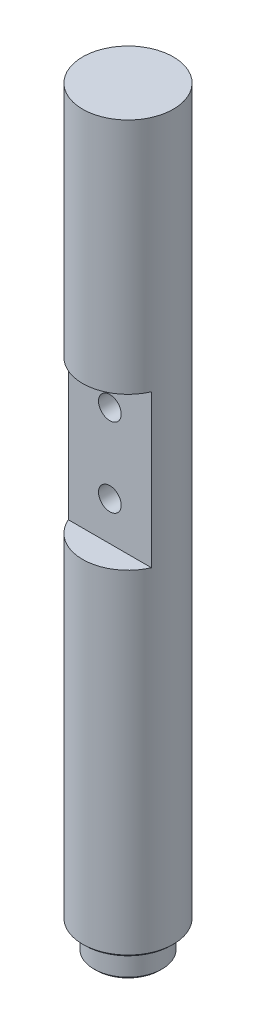
ISO-10303-21;
HEADER;
FILE_DESCRIPTION(('STEP AP214'),'2;1');
FILE_NAME('part.step','',(''),(''),'','','');
FILE_SCHEMA(('AUTOMOTIVE_DESIGN { 1 0 10303 214 1 1 1 1 }'));
ENDSEC;
DATA;
#1=APPLICATION_CONTEXT('core data for automotive mechanical design processes');
#2=APPLICATION_PROTOCOL_DEFINITION('international standard','automotive_design',2000,#1);
#3=PRODUCT_CONTEXT('',#1,'mechanical');
#4=PRODUCT('Part','Part','',(#3));
#5=PRODUCT_RELATED_PRODUCT_CATEGORY('part','',(#4));
#6=PRODUCT_DEFINITION_FORMATION('','',#4);
#7=PRODUCT_DEFINITION_CONTEXT('part definition',#1,'design');
#8=PRODUCT_DEFINITION('design','',#6,#7);
#9=PRODUCT_DEFINITION_SHAPE('','',#8);
#10=(LENGTH_UNIT() NAMED_UNIT(*) SI_UNIT(.MILLI.,.METRE.));
#11=(NAMED_UNIT(*) PLANE_ANGLE_UNIT() SI_UNIT($,.RADIAN.));
#12=(NAMED_UNIT(*) SI_UNIT($,.STERADIAN.) SOLID_ANGLE_UNIT());
#13=UNCERTAINTY_MEASURE_WITH_UNIT(LENGTH_MEASURE(1.E-05),#10,'distance_accuracy_value','');
#14=(GEOMETRIC_REPRESENTATION_CONTEXT(3) GLOBAL_UNCERTAINTY_ASSIGNED_CONTEXT((#13)) GLOBAL_UNIT_ASSIGNED_CONTEXT((#10,
#11,#12)) REPRESENTATION_CONTEXT('',''));
#15=CARTESIAN_POINT('',(0.,0.,0.));
#16=DIRECTION('',(0.,0.,1.));
#17=DIRECTION('',(1.,0.,0.));
#18=AXIS2_PLACEMENT_3D('',#15,#16,#17);
#19=CARTESIAN_POINT('',(0.,203.2,0.));
#20=DIRECTION('',(0.,-1.,0.));
#21=DIRECTION('',(0.,0.,-1.));
#22=AXIS2_PLACEMENT_3D('',#19,#20,#21);
#23=CYLINDRICAL_SURFACE('',#22,12.7);
#24=CARTESIAN_POINT('',(0.,130.175,-12.7));
#25=CARTESIAN_POINT('',(-0.175421054350933,130.174995077188,-12.6999970338729));
#26=CARTESIAN_POINT('',(-0.350897100741785,130.160412884195,-12.6963292371237));
#27=CARTESIAN_POINT('',(-0.696820051980964,130.102556763067,-12.6820530760661));
#28=CARTESIAN_POINT('',(-0.867264049209735,130.059266573145,-12.6714407780562));
#29=CARTESIAN_POINT('',(-1.19807751278645,129.945470246839,-12.6444507573613));
#30=CARTESIAN_POINT('',(-1.35845880926017,129.874996792719,-12.6280799601569));
#31=CARTESIAN_POINT('',(-1.6651226791977,129.708949391072,-12.591316443928));
#32=CARTESIAN_POINT('',(-1.81140477687155,129.613374596882,-12.5709235892463));
#33=CARTESIAN_POINT('',(-2.08873074612027,129.397758328565,-12.5278602543575));
#34=CARTESIAN_POINT('',(-2.21944287729589,129.277297166337,-12.5051546346353));
#35=CARTESIAN_POINT('',(-2.45903522924702,129.016226166276,-12.4602582924963));
#36=CARTESIAN_POINT('',(-2.56791298487578,128.875614056429,-12.4380676284689));
#37=CARTESIAN_POINT('',(-2.76230618225783,128.575656770073,-12.3963594189446));
#38=CARTESIAN_POINT('',(-2.84745052370821,128.416064328122,-12.3768864828385));
#39=CARTESIAN_POINT('',(-2.98957345643241,128.084265861986,-12.343330973648));
#40=CARTESIAN_POINT('',(-3.04655655068163,127.912061859447,-12.3292475388652));
#41=CARTESIAN_POINT('',(-3.12960773790342,127.56357626214,-12.3084267567388));
#42=CARTESIAN_POINT('',(-3.15627230130284,127.387445470053,-12.3015478927701));
#43=CARTESIAN_POINT('',(-3.17978742389056,127.033086528951,-12.2954915053947));
#44=CARTESIAN_POINT('',(-3.176642833515,126.854858725868,-12.2963127290578));
#45=CARTESIAN_POINT('',(-3.14110481048737,126.505936540272,-12.3054365167726));
#46=CARTESIAN_POINT('',(-3.1094221534035,126.335164267898,-12.3135572669877));
#47=CARTESIAN_POINT('',(-3.01884119561133,126.001439108905,-12.3360753547043));
#48=CARTESIAN_POINT('',(-2.95994095604688,125.838486780255,-12.3504731393489));
#49=CARTESIAN_POINT('',(-2.8159910616337,125.523121198933,-12.3840899110031));
#50=CARTESIAN_POINT('',(-2.730683445643,125.370830936379,-12.4033560981111));
#51=CARTESIAN_POINT('',(-2.53652078423163,125.082472064348,-12.4445122129068));
#52=CARTESIAN_POINT('',(-2.42766161831204,124.946406299924,-12.4664025994163));
#53=CARTESIAN_POINT('',(-2.18580424890859,124.690285680114,-12.5111061380944));
#54=CARTESIAN_POINT('',(-2.05220624645107,124.570797996037,-12.533927803951));
#55=CARTESIAN_POINT('',(-1.76659522538283,124.355815036785,-12.5773596047503));
#56=CARTESIAN_POINT('',(-1.61458164448181,124.260320494475,-12.5979696721291));
#57=CARTESIAN_POINT('',(-1.29564529770894,124.095826259158,-12.6347586626604));
#58=CARTESIAN_POINT('',(-1.12867311562491,124.026918696461,-12.6509221227036));
#59=CARTESIAN_POINT('',(-0.785020883902429,123.918308369581,-12.676884242985));
#60=CARTESIAN_POINT('',(-0.608342698201854,123.878600018915,-12.6866841206814));
#61=CARTESIAN_POINT('',(-0.255142937325553,123.830381486234,-12.6986347345774));
#62=CARTESIAN_POINT('',(-0.0787330573083737,123.821098928141,-12.7009747992585));
#63=CARTESIAN_POINT('',(0.27311958499653,123.831877054351,-12.6982813685726));
#64=CARTESIAN_POINT('',(0.448562432914398,123.851935097258,-12.6932485369526));
#65=CARTESIAN_POINT('',(0.790816868910242,123.920188422762,-12.6764961338622));
#66=CARTESIAN_POINT('',(0.957717835150525,123.967962341026,-12.6648767569325));
#67=CARTESIAN_POINT('',(1.28112793569116,124.089809994527,-12.6362609570897));
#68=CARTESIAN_POINT('',(1.43763601861912,124.163886385796,-12.6192639911647));
#69=CARTESIAN_POINT('',(1.73889063454314,124.337733139451,-12.5813250177716));
#70=CARTESIAN_POINT('',(1.88337918521904,124.437936104573,-12.5603183592593));
#71=CARTESIAN_POINT('',(2.15376466554501,124.660638640287,-12.5167921111412));
#72=CARTESIAN_POINT('',(2.27965837982672,124.783142058857,-12.4942722608556));
#73=CARTESIAN_POINT('',(2.51246336908675,125.050554150453,-12.4495762556412));
#74=CARTESIAN_POINT('',(2.6188328531313,125.195938971349,-12.4274221051899));
#75=CARTESIAN_POINT('',(2.80566443991221,125.502950742958,-12.3865825924258));
#76=CARTESIAN_POINT('',(2.88612769264178,125.664576972287,-12.3678970761538));
#77=CARTESIAN_POINT('',(3.0182638402854,125.998617112427,-12.3363163381503));
#78=CARTESIAN_POINT('',(3.07010730622843,126.170960146596,-12.3233869021911));
#79=CARTESIAN_POINT('',(3.14398164687971,126.522288733459,-12.3047494152553));
#80=CARTESIAN_POINT('',(3.16601904149253,126.701272824656,-12.299039785006));
#81=CARTESIAN_POINT('',(3.17931501621074,127.05528950052,-12.2956087422145));
#82=CARTESIAN_POINT('',(3.17143955029538,127.230287904387,-12.2976625750886));
#83=CARTESIAN_POINT('',(3.1271152390873,127.576376564376,-12.3090074061494));
#84=CARTESIAN_POINT('',(3.09066696801937,127.747466898967,-12.3182982588945));
#85=CARTESIAN_POINT('',(2.9907046261569,128.079941238344,-12.3429450180984));
#86=CARTESIAN_POINT('',(2.92735297324093,128.241376962755,-12.3582644892528));
#87=CARTESIAN_POINT('',(2.7755107337966,128.551443393414,-12.3932474960913));
#88=CARTESIAN_POINT('',(2.68701666057215,128.700072319913,-12.4129116342002));
#89=CARTESIAN_POINT('',(2.48468673461549,128.984490631387,-12.4550092586011));
#90=CARTESIAN_POINT('',(2.37025002816432,129.119843938747,-12.4775016056118));
#91=CARTESIAN_POINT('',(2.1204541690182,129.369707911484,-12.5223699100401));
#92=CARTESIAN_POINT('',(1.98509005500273,129.484213620406,-12.5447458385544));
#93=CARTESIAN_POINT('',(1.69432305852049,129.691153936462,-12.5873437112106));
#94=CARTESIAN_POINT('',(1.53860166056969,129.783151265605,-12.6075193062447));
#95=CARTESIAN_POINT('',(1.21341315929717,129.939515463224,-12.6429542453062));
#96=CARTESIAN_POINT('',(1.04395600927443,130.003902130039,-12.6582171100619));
#97=CARTESIAN_POINT('',(0.729001702698686,130.093660374198,-12.6798505941374));
#98=CARTESIAN_POINT('',(0.58500469508875,130.124096797796,-12.6873547169486));
#99=CARTESIAN_POINT('',(0.29401785141847,130.164767914,-12.6974304774096));
#100=CARTESIAN_POINT('',(0.147028241296873,130.17500412603,-12.7000024860439));
#101=CARTESIAN_POINT('',(0.,130.175,-12.7));
#102=B_SPLINE_CURVE_WITH_KNOTS('',3,(#24,#25,#26,#27,#28,#29,#30,#31,#32,#33,#34,#35,#36,#37,
#38,#39,#40,#41,#42,#43,#44,#45,#46,#47,#48,#49,#50,#51,#52,#53,#54,#55,#56,#57,#58,#59,#60,#61,
#62,#63,#64,#65,#66,#67,#68,#69,#70,#71,#72,#73,#74,#75,#76,#77,#78,#79,#80,#81,#82,#83,#84,#85,
#86,#87,#88,#89,#90,#91,#92,#93,#94,#95,#96,#97,#98,#99,#100,#101),.UNSPECIFIED.,.T.,.F.,(4,2,2,
2,2,2,2,2,2,2,2,2,2,2,2,2,2,2,2,2,2,2,2,2,2,2,2,2,2,2,2,2,2,2,2,2,2,2,4),(0.,0.525724358065502,
1.05174676993359,1.57713870983892,2.10254837335841,2.63767221675275,3.17285644277796,
3.7159913730529,4.25903942808498,4.79120824630598,5.3232904734557,5.84247618671886,
6.36169889010144,6.8861628400674,7.41071862276905,7.95023177058119,8.48976139571986,
9.0311441807632,9.57242335981323,10.09985087283,10.6272309069567,11.1467958106174,
11.6664131950588,12.1952509368702,12.7241800170733,13.266092111565,13.8079801469349,
14.34660272276,14.885107458967,15.4081433519175,15.9311687337377,16.4510804786766,
16.971064359066,17.5046127008448,18.0382877269755,18.5816279265762,19.1245778677202,
19.5652441424438,20.005877269746),.UNSPECIFIED.);
#103=CARTESIAN_POINT('',(0.,130.175,-12.7));
#104=VERTEX_POINT('',#103);
#105=EDGE_CURVE('E135',#104,#104,#102,.T.);
#106=ORIENTED_EDGE('',*,*,#105,.T.);
#107=EDGE_LOOP('',(#106));
#108=FACE_BOUND('',#107,.T.);
#109=CARTESIAN_POINT('',(0.,108.077,-12.7));
#110=CARTESIAN_POINT('',(-0.175421054350931,108.076995077188,-12.6999970338729));
#111=CARTESIAN_POINT('',(-0.350897100741782,108.062412884195,-12.6963292371237));
#112=CARTESIAN_POINT('',(-0.696820051980961,108.004556763067,-12.6820530760661));
#113=CARTESIAN_POINT('',(-0.867264049209733,107.961266573145,-12.6714407780562));
#114=CARTESIAN_POINT('',(-1.19807751278646,107.847470246839,-12.6444507573613));
#115=CARTESIAN_POINT('',(-1.35845880926018,107.776996792719,-12.6280799601569));
#116=CARTESIAN_POINT('',(-1.66512267919771,107.610949391072,-12.591316443928));
#117=CARTESIAN_POINT('',(-1.81140477687155,107.515374596882,-12.5709235892463));
#118=CARTESIAN_POINT('',(-2.08873074612027,107.299758328565,-12.5278602543575));
#119=CARTESIAN_POINT('',(-2.2194428772959,107.179297166337,-12.5051546346353));
#120=CARTESIAN_POINT('',(-2.45903522924703,106.918226166276,-12.4602582924963));
#121=CARTESIAN_POINT('',(-2.56791298487579,106.777614056429,-12.4380676284689));
#122=CARTESIAN_POINT('',(-2.76230618225783,106.477656770073,-12.3963594189446));
#123=CARTESIAN_POINT('',(-2.84745052370821,106.318064328122,-12.3768864828385));
#124=CARTESIAN_POINT('',(-2.9895734564324,105.986265861986,-12.343330973648));
#125=CARTESIAN_POINT('',(-3.04655655068163,105.814061859447,-12.3292475388652));
#126=CARTESIAN_POINT('',(-3.12960773790341,105.46557626214,-12.3084267567388));
#127=CARTESIAN_POINT('',(-3.15627230130284,105.289445470053,-12.3015478927701));
#128=CARTESIAN_POINT('',(-3.17978742389056,104.935086528951,-12.2954915053947));
#129=CARTESIAN_POINT('',(-3.176642833515,104.756858725868,-12.2963127290578));
#130=CARTESIAN_POINT('',(-3.14110481048737,104.407936540272,-12.3054365167726));
#131=CARTESIAN_POINT('',(-3.1094221534035,104.237164267898,-12.3135572669877));
#132=CARTESIAN_POINT('',(-3.01884119561133,103.903439108905,-12.3360753547043));
#133=CARTESIAN_POINT('',(-2.95994095604687,103.740486780255,-12.3504731393489));
#134=CARTESIAN_POINT('',(-2.8159910616337,103.425121198933,-12.3840899110031));
#135=CARTESIAN_POINT('',(-2.73068344564301,103.272830936379,-12.4033560981111));
#136=CARTESIAN_POINT('',(-2.53652078423164,102.984472064348,-12.4445122129068));
#137=CARTESIAN_POINT('',(-2.42766161831204,102.848406299924,-12.4664025994163));
#138=CARTESIAN_POINT('',(-2.18580424890858,102.592285680114,-12.5111061380944));
#139=CARTESIAN_POINT('',(-2.05220624645107,102.472797996037,-12.533927803951));
#140=CARTESIAN_POINT('',(-1.76659522538282,102.257815036785,-12.5773596047503));
#141=CARTESIAN_POINT('',(-1.6145816444818,102.162320494475,-12.5979696721291));
#142=CARTESIAN_POINT('',(-1.29564529770893,101.997826259158,-12.6347586626604));
#143=CARTESIAN_POINT('',(-1.12867311562491,101.928918696461,-12.6509221227036));
#144=CARTESIAN_POINT('',(-0.785020883902425,101.820308369581,-12.676884242985));
#145=CARTESIAN_POINT('',(-0.608342698201851,101.780600018915,-12.6866841206814));
#146=CARTESIAN_POINT('',(-0.255142937325549,101.732381486234,-12.6986347345774));
#147=CARTESIAN_POINT('',(-0.0787330573083697,101.723098928141,-12.7009747992585));
#148=CARTESIAN_POINT('',(0.273119584996534,101.733877054351,-12.6982813685726));
#149=CARTESIAN_POINT('',(0.448562432914402,101.753935097258,-12.6932485369526));
#150=CARTESIAN_POINT('',(0.790816868910244,101.822188422762,-12.6764961338622));
#151=CARTESIAN_POINT('',(0.957717835150527,101.869962341026,-12.6648767569325));
#152=CARTESIAN_POINT('',(1.28112793569116,101.991809994527,-12.6362609570897));
#153=CARTESIAN_POINT('',(1.43763601861912,102.065886385796,-12.6192639911647));
#154=CARTESIAN_POINT('',(1.73889063454314,102.239733139451,-12.5813250177716));
#155=CARTESIAN_POINT('',(1.88337918521904,102.339936104573,-12.5603183592593));
#156=CARTESIAN_POINT('',(2.15376466554502,102.562638640287,-12.5167921111412));
#157=CARTESIAN_POINT('',(2.27965837982672,102.685142058857,-12.4942722608556));
#158=CARTESIAN_POINT('',(2.51246336908675,102.952554150453,-12.4495762556412));
#159=CARTESIAN_POINT('',(2.6188328531313,103.097938971349,-12.4274221051899));
#160=CARTESIAN_POINT('',(2.80566443991222,103.404950742958,-12.3865825924258));
#161=CARTESIAN_POINT('',(2.88612769264178,103.566576972287,-12.3678970761538));
#162=CARTESIAN_POINT('',(3.01826384028541,103.900617112427,-12.3363163381503));
#163=CARTESIAN_POINT('',(3.07010730622843,104.072960146596,-12.3233869021911));
#164=CARTESIAN_POINT('',(3.14398164687971,104.424288733459,-12.3047494152553));
#165=CARTESIAN_POINT('',(3.16601904149253,104.603272824656,-12.299039785006));
#166=CARTESIAN_POINT('',(3.17931501621074,104.95728950052,-12.2956087422145));
#167=CARTESIAN_POINT('',(3.17143955029538,105.132287904387,-12.2976625750886));
#168=CARTESIAN_POINT('',(3.1271152390873,105.478376564376,-12.3090074061494));
#169=CARTESIAN_POINT('',(3.09066696801937,105.649466898967,-12.3182982588945));
#170=CARTESIAN_POINT('',(2.9907046261569,105.981941238344,-12.3429450180984));
#171=CARTESIAN_POINT('',(2.92735297324093,106.143376962755,-12.3582644892528));
#172=CARTESIAN_POINT('',(2.7755107337966,106.453443393414,-12.3932474960913));
#173=CARTESIAN_POINT('',(2.68701666057215,106.602072319913,-12.4129116342002));
#174=CARTESIAN_POINT('',(2.48468673461549,106.886490631387,-12.4550092586011));
#175=CARTESIAN_POINT('',(2.37025002816433,107.021843938747,-12.4775016056118));
#176=CARTESIAN_POINT('',(2.12045416901821,107.271707911484,-12.5223699100401));
#177=CARTESIAN_POINT('',(1.98509005500274,107.386213620406,-12.5447458385544));
#178=CARTESIAN_POINT('',(1.69432305852049,107.593153936462,-12.5873437112106));
#179=CARTESIAN_POINT('',(1.53860166056969,107.685151265605,-12.6075193062447));
#180=CARTESIAN_POINT('',(1.21341315929717,107.841515463224,-12.6429542453062));
#181=CARTESIAN_POINT('',(1.04395600927443,107.905902130039,-12.6582171100619));
#182=CARTESIAN_POINT('',(0.729001702698677,107.995660374198,-12.6798505941374));
#183=CARTESIAN_POINT('',(0.585004695088742,108.026096797796,-12.6873547169486));
#184=CARTESIAN_POINT('',(0.294017851418465,108.066767914,-12.6974304774096));
#185=CARTESIAN_POINT('',(0.147028241296871,108.07700412603,-12.7000024860439));
#186=CARTESIAN_POINT('',(0.,108.077,-12.7));
#187=B_SPLINE_CURVE_WITH_KNOTS('',3,(#109,#110,#111,#112,#113,#114,#115,#116,#117,#118,#119,
#120,#121,#122,#123,#124,#125,#126,#127,#128,#129,#130,#131,#132,#133,#134,#135,#136,#137,#138,
#139,#140,#141,#142,#143,#144,#145,#146,#147,#148,#149,#150,#151,#152,#153,#154,#155,#156,#157,
#158,#159,#160,#161,#162,#163,#164,#165,#166,#167,#168,#169,#170,#171,#172,#173,#174,#175,#176,
#177,#178,#179,#180,#181,#182,#183,#184,#185,#186),.UNSPECIFIED.,.T.,.F.,(4,2,2,2,2,2,2,2,2,2,2,
2,2,2,2,2,2,2,2,2,2,2,2,2,2,2,2,2,2,2,2,2,2,2,2,2,2,2,4),(0.,0.5257243580655,1.05174676993359,
1.57713870983893,2.10254837335842,2.63767221675278,3.17285644277798,3.7159913730529,
4.25903942808496,4.79120824630598,5.32329047345571,5.84247618671883,6.36169889010144,
6.88616284006738,7.41071862276905,7.95023177058119,8.48976139571986,9.0311441807632,
9.57242335981322,10.09985087283,10.6272309069567,11.1467958106174,11.6664131950588,
12.1952509368702,12.7241800170733,13.266092111565,13.8079801469349,14.34660272276,
14.8851074589671,15.4081433519175,15.9311687337377,16.4510804786766,16.9710643590661,
17.5046127008447,18.0382877269755,18.5816279265762,19.1245778677202,19.5652441424438,
20.005877269746),.UNSPECIFIED.);
#188=CARTESIAN_POINT('',(0.,108.077,-12.7));
#189=VERTEX_POINT('',#188);
#190=EDGE_CURVE('E71',#189,#189,#187,.T.);
#191=ORIENTED_EDGE('',*,*,#190,.T.);
#192=EDGE_LOOP('',(#191));
#193=FACE_BOUND('',#192,.T.);
#194=CARTESIAN_POINT('',(0.,203.2,0.));
#195=DIRECTION('',(0.,1.,0.));
#196=DIRECTION('',(0.,0.,1.));
#197=AXIS2_PLACEMENT_3D('',#194,#195,#196);
#198=CIRCLE('',#197,12.7);
#199=CARTESIAN_POINT('',(0.,203.2,12.7));
#200=VERTEX_POINT('',#199);
#201=EDGE_CURVE('E73',#200,#200,#198,.T.);
#202=ORIENTED_EDGE('',*,*,#201,.F.);
#203=EDGE_LOOP('',(#202));
#204=FACE_BOUND('',#203,.T.);
#205=CARTESIAN_POINT('',(0.,0.634999999999969,0.));
#206=DIRECTION('',(0.,1.,0.));
#207=DIRECTION('',(0.,0.,1.));
#208=AXIS2_PLACEMENT_3D('',#205,#206,#207);
#209=CIRCLE('',#208,12.7);
#210=CARTESIAN_POINT('',(0.,0.634999999999969,12.7));
#211=VERTEX_POINT('',#210);
#212=EDGE_CURVE('E89',#211,#211,#209,.T.);
#213=ORIENTED_EDGE('',*,*,#212,.T.);
#214=EDGE_LOOP('',(#213));
#215=FACE_BOUND('',#214,.T.);
#216=DIRECTION('',(0.,-1.,0.));
#217=VECTOR('',#216,1.);
#218=CARTESIAN_POINT('',(11.6397422651878,203.2,5.08000000000001));
#219=LINE('',#218,#217);
#220=CARTESIAN_POINT('',(11.6397422651878,93.98,5.08));
#221=VERTEX_POINT('',#220);
#222=CARTESIAN_POINT('',(11.6397422651878,136.652,5.08));
#223=VERTEX_POINT('',#222);
#224=EDGE_CURVE('E61',#221,#223,#219,.F.);
#225=ORIENTED_EDGE('',*,*,#224,.F.);
#226=CARTESIAN_POINT('',(0.,93.98,0.));
#227=DIRECTION('',(0.,1.,0.));
#228=DIRECTION('',(0.,0.,1.));
#229=AXIS2_PLACEMENT_3D('',#226,#227,#228);
#230=CIRCLE('',#229,12.7);
#231=CARTESIAN_POINT('',(-11.6397422651878,93.98,5.08));
#232=VERTEX_POINT('',#231);
#233=EDGE_CURVE('E11',#232,#221,#230,.T.);
#234=ORIENTED_EDGE('',*,*,#233,.F.);
#235=DIRECTION('',(0.,-1.,0.));
#236=VECTOR('',#235,1.);
#237=CARTESIAN_POINT('',(-11.6397422651878,203.2,5.08000000000001));
#238=LINE('',#237,#236);
#239=CARTESIAN_POINT('',(-11.6397422651878,136.652,5.08));
#240=VERTEX_POINT('',#239);
#241=EDGE_CURVE('E41',#240,#232,#238,.T.);
#242=ORIENTED_EDGE('',*,*,#241,.F.);
#243=CARTESIAN_POINT('',(0.,136.652,0.));
#244=DIRECTION('',(0.,-1.,0.));
#245=DIRECTION('',(0.,0.,-1.));
#246=AXIS2_PLACEMENT_3D('',#243,#244,#245);
#247=CIRCLE('',#246,12.7);
#248=EDGE_CURVE('E59',#223,#240,#247,.T.);
#249=ORIENTED_EDGE('',*,*,#248,.F.);
#250=EDGE_LOOP('',(#225,#234,#242,#249));
#251=FACE_BOUND('',#250,.T.);
#252=ADVANCED_FACE('F33',(#108,#193,#204,#215,#251),#23,.T.);
#253=CARTESIAN_POINT('',(0.,0.,0.));
#254=DIRECTION('',(0.,1.,0.));
#255=DIRECTION('',(0.,0.,1.));
#256=AXIS2_PLACEMENT_3D('',#253,#254,#255);
#257=PLANE('',#256);
#258=CARTESIAN_POINT('',(0.,0.,0.));
#259=DIRECTION('',(0.,1.,0.));
#260=DIRECTION('',(0.,0.,1.));
#261=AXIS2_PLACEMENT_3D('',#258,#259,#260);
#262=CIRCLE('',#261,12.065);
#263=CARTESIAN_POINT('',(0.,0.,12.065));
#264=VERTEX_POINT('',#263);
#265=EDGE_CURVE('E92',#264,#264,#262,.F.);
#266=ORIENTED_EDGE('',*,*,#265,.T.);
#267=EDGE_LOOP('',(#266));
#268=FACE_BOUND('',#267,.T.);
#269=CARTESIAN_POINT('',(0.,0.,0.));
#270=DIRECTION('',(0.,1.,0.));
#271=DIRECTION('',(0.,0.,1.));
#272=AXIS2_PLACEMENT_3D('',#269,#270,#271);
#273=CIRCLE('',#272,9.525);
#274=CARTESIAN_POINT('',(0.,0.,9.525));
#275=VERTEX_POINT('',#274);
#276=EDGE_CURVE('E86',#275,#275,#273,.F.);
#277=ORIENTED_EDGE('',*,*,#276,.F.);
#278=EDGE_LOOP('',(#277));
#279=FACE_BOUND('',#278,.T.);
#280=ADVANCED_FACE('F122',(#268,#279),#257,.F.);
#281=CARTESIAN_POINT('',(0.,203.2,0.));
#282=DIRECTION('',(0.,1.,0.));
#283=DIRECTION('',(0.,0.,1.));
#284=AXIS2_PLACEMENT_3D('',#281,#282,#283);
#285=PLANE('',#284);
#286=ORIENTED_EDGE('',*,*,#201,.T.);
#287=EDGE_LOOP('',(#286));
#288=FACE_BOUND('',#287,.T.);
#289=ADVANCED_FACE('F118',(#288),#285,.T.);
#290=CARTESIAN_POINT('',(0.,-7.62,0.));
#291=DIRECTION('',(0.,1.,0.));
#292=DIRECTION('',(0.,0.,1.));
#293=AXIS2_PLACEMENT_3D('',#290,#291,#292);
#294=CYLINDRICAL_SURFACE('',#293,9.525);
#295=CARTESIAN_POINT('',(0.,-6.9850000000001,0.));
#296=DIRECTION('',(0.,-1.,0.));
#297=DIRECTION('',(0.,0.,-1.));
#298=AXIS2_PLACEMENT_3D('',#295,#296,#297);
#299=CIRCLE('',#298,9.525);
#300=CARTESIAN_POINT('',(0.,-6.9850000000001,-9.525));
#301=VERTEX_POINT('',#300);
#302=EDGE_CURVE('E64',#301,#301,#299,.F.);
#303=ORIENTED_EDGE('',*,*,#302,.T.);
#304=EDGE_LOOP('',(#303));
#305=FACE_BOUND('',#304,.T.);
#306=ORIENTED_EDGE('',*,*,#276,.T.);
#307=EDGE_LOOP('',(#306));
#308=FACE_BOUND('',#307,.T.);
#309=ADVANCED_FACE('F101',(#305,#308),#294,.T.);
#310=CARTESIAN_POINT('',(0.,-7.62,0.));
#311=DIRECTION('',(0.,-1.,0.));
#312=DIRECTION('',(0.,0.,-1.));
#313=AXIS2_PLACEMENT_3D('',#310,#311,#312);
#314=PLANE('',#313);
#315=CARTESIAN_POINT('',(0.,-7.62,0.));
#316=DIRECTION('',(0.,-1.,0.));
#317=DIRECTION('',(0.,0.,-1.));
#318=AXIS2_PLACEMENT_3D('',#315,#316,#317);
#319=CIRCLE('',#318,8.89000000000009);
#320=CARTESIAN_POINT('',(0.,-7.62,-8.89000000000009));
#321=VERTEX_POINT('',#320);
#322=EDGE_CURVE('E95',#321,#321,#319,.T.);
#323=ORIENTED_EDGE('',*,*,#322,.T.);
#324=EDGE_LOOP('',(#323));
#325=FACE_BOUND('',#324,.T.);
#326=ADVANCED_FACE('F110',(#325),#314,.T.);
#327=CARTESIAN_POINT('',(0.,0.634999999999969,0.));
#328=DIRECTION('',(0.,1.,0.));
#329=DIRECTION('',(0.,0.,1.));
#330=AXIS2_PLACEMENT_3D('',#327,#328,#329);
#331=CONICAL_SURFACE('',#330,12.7,0.785398163397433);
#332=ORIENTED_EDGE('',*,*,#265,.F.);
#333=EDGE_LOOP('',(#332));
#334=FACE_BOUND('',#333,.T.);
#335=ORIENTED_EDGE('',*,*,#212,.F.);
#336=EDGE_LOOP('',(#335));
#337=FACE_BOUND('',#336,.T.);
#338=ADVANCED_FACE('F107',(#334,#337),#331,.T.);
#339=CARTESIAN_POINT('',(0.,-7.62,0.));
#340=DIRECTION('',(0.,1.,0.));
#341=DIRECTION('',(0.,0.,1.));
#342=AXIS2_PLACEMENT_3D('',#339,#340,#341);
#343=CONICAL_SURFACE('',#342,8.89000000000009,0.785398163397455);
#344=ORIENTED_EDGE('',*,*,#302,.F.);
#345=EDGE_LOOP('',(#344));
#346=FACE_BOUND('',#345,.T.);
#347=ORIENTED_EDGE('',*,*,#322,.F.);
#348=EDGE_LOOP('',(#347));
#349=FACE_BOUND('',#348,.T.);
#350=ADVANCED_FACE('F35',(#346,#349),#343,.T.);
#351=CARTESIAN_POINT('',(25.4,93.98,12.7));
#352=DIRECTION('',(0.,1.,0.));
#353=DIRECTION('',(0.,0.,1.));
#354=AXIS2_PLACEMENT_3D('',#351,#352,#353);
#355=PLANE('',#354);
#356=ORIENTED_EDGE('',*,*,#233,.T.);
#357=DIRECTION('',(-1.,0.,0.));
#358=VECTOR('',#357,1.);
#359=CARTESIAN_POINT('',(25.4,93.98,5.08));
#360=LINE('',#359,#358);
#361=EDGE_CURVE('E68',#221,#232,#360,.T.);
#362=ORIENTED_EDGE('',*,*,#361,.T.);
#363=EDGE_LOOP('',(#356,#362));
#364=FACE_BOUND('',#363,.T.);
#365=ADVANCED_FACE('F106',(#364),#355,.T.);
#366=CARTESIAN_POINT('',(25.4,136.652,5.08));
#367=DIRECTION('',(0.,0.,1.));
#368=DIRECTION('',(0.,-1.,0.));
#369=AXIS2_PLACEMENT_3D('',#366,#367,#368);
#370=PLANE('',#369);
#371=CARTESIAN_POINT('',(0.,127.,5.07999999999999));
#372=DIRECTION('',(0.,0.,1.));
#373=DIRECTION('',(1.,0.,0.));
#374=AXIS2_PLACEMENT_3D('',#371,#372,#373);
#375=CIRCLE('',#374,3.175);
#376=CARTESIAN_POINT('',(3.175,127.,5.07999999999999));
#377=VERTEX_POINT('',#376);
#378=EDGE_CURVE('E140',#377,#377,#375,.T.);
#379=ORIENTED_EDGE('',*,*,#378,.F.);
#380=EDGE_LOOP('',(#379));
#381=FACE_BOUND('',#380,.T.);
#382=CARTESIAN_POINT('',(0.,104.902,5.07999999999999));
#383=DIRECTION('',(0.,0.,1.));
#384=DIRECTION('',(1.,0.,0.));
#385=AXIS2_PLACEMENT_3D('',#382,#383,#384);
#386=CIRCLE('',#385,3.175);
#387=CARTESIAN_POINT('',(3.175,104.902,5.07999999999999));
#388=VERTEX_POINT('',#387);
#389=EDGE_CURVE('E76',#388,#388,#386,.T.);
#390=ORIENTED_EDGE('',*,*,#389,.F.);
#391=EDGE_LOOP('',(#390));
#392=FACE_BOUND('',#391,.T.);
#393=ORIENTED_EDGE('',*,*,#241,.T.);
#394=ORIENTED_EDGE('',*,*,#361,.F.);
#395=ORIENTED_EDGE('',*,*,#224,.T.);
#396=DIRECTION('',(-1.,0.,0.));
#397=VECTOR('',#396,1.);
#398=CARTESIAN_POINT('',(25.4,136.652,5.08));
#399=LINE('',#398,#397);
#400=EDGE_CURVE('E67',#223,#240,#399,.T.);
#401=ORIENTED_EDGE('',*,*,#400,.T.);
#402=EDGE_LOOP('',(#393,#394,#395,#401));
#403=FACE_BOUND('',#402,.T.);
#404=ADVANCED_FACE('F66',(#381,#392,#403),#370,.T.);
#405=CARTESIAN_POINT('',(25.4,136.652,12.7));
#406=DIRECTION('',(0.,-1.,0.));
#407=DIRECTION('',(0.,0.,-1.));
#408=AXIS2_PLACEMENT_3D('',#405,#406,#407);
#409=PLANE('',#408);
#410=ORIENTED_EDGE('',*,*,#400,.F.);
#411=ORIENTED_EDGE('',*,*,#248,.T.);
#412=EDGE_LOOP('',(#410,#411));
#413=FACE_BOUND('',#412,.T.);
#414=ADVANCED_FACE('F70',(#413),#409,.T.);
#415=CARTESIAN_POINT('',(0.,104.902,-20.32));
#416=DIRECTION('',(0.,0.,1.));
#417=DIRECTION('',(1.,0.,0.));
#418=AXIS2_PLACEMENT_3D('',#415,#416,#417);
#419=CYLINDRICAL_SURFACE('',#418,3.175);
#420=ORIENTED_EDGE('',*,*,#389,.T.);
#421=EDGE_LOOP('',(#420));
#422=FACE_BOUND('',#421,.T.);
#423=ORIENTED_EDGE('',*,*,#190,.F.);
#424=EDGE_LOOP('',(#423));
#425=FACE_BOUND('',#424,.T.);
#426=ADVANCED_FACE('F144',(#422,#425),#419,.F.);
#427=CARTESIAN_POINT('',(0.,127.,-20.32));
#428=DIRECTION('',(0.,0.,1.));
#429=DIRECTION('',(1.,0.,0.));
#430=AXIS2_PLACEMENT_3D('',#427,#428,#429);
#431=CYLINDRICAL_SURFACE('',#430,3.175);
#432=ORIENTED_EDGE('',*,*,#378,.T.);
#433=EDGE_LOOP('',(#432));
#434=FACE_BOUND('',#433,.T.);
#435=ORIENTED_EDGE('',*,*,#105,.F.);
#436=EDGE_LOOP('',(#435));
#437=FACE_BOUND('',#436,.T.);
#438=ADVANCED_FACE('F141',(#434,#437),#431,.F.);
#439=CLOSED_SHELL('',(#252,#280,#289,#309,#326,#338,#350,#365,#404,#414,#426,#438));
#440=MANIFOLD_SOLID_BREP('B2',#439);
#441=ADVANCED_BREP_SHAPE_REPRESENTATION('',(#18,#440),#14);
#442=SHAPE_DEFINITION_REPRESENTATION(#9,#441);
ENDSEC;
END-ISO-10303-21;
